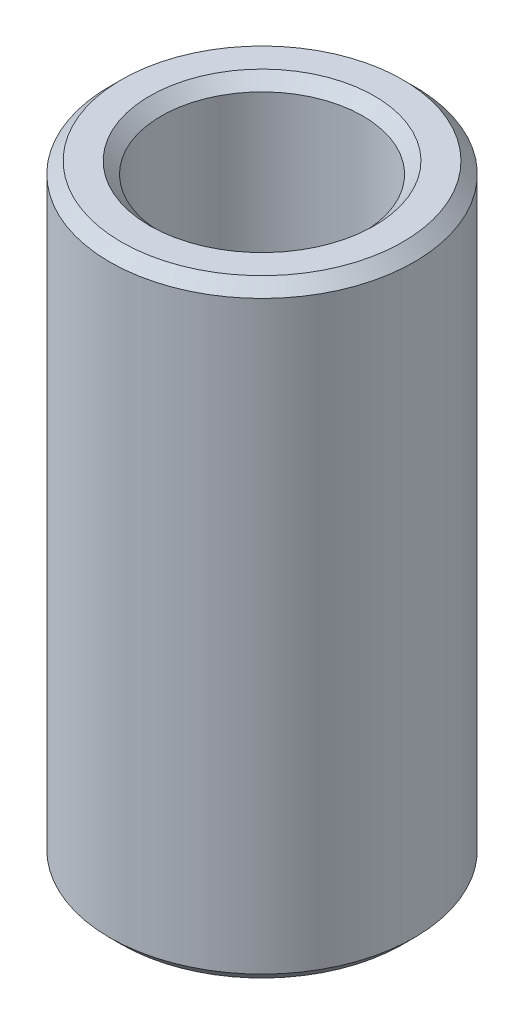
ISO-10303-21;
HEADER;
FILE_DESCRIPTION(('STEP AP214'),'2;1');
FILE_NAME('part.step','',(''),(''),'','','');
FILE_SCHEMA(('AUTOMOTIVE_DESIGN { 1 0 10303 214 1 1 1 1 }'));
ENDSEC;
DATA;
#1=APPLICATION_CONTEXT('core data for automotive mechanical design processes');
#2=APPLICATION_PROTOCOL_DEFINITION('international standard','automotive_design',2000,#1);
#3=PRODUCT_CONTEXT('',#1,'mechanical');
#4=PRODUCT('Part','Part','',(#3));
#5=PRODUCT_RELATED_PRODUCT_CATEGORY('part','',(#4));
#6=PRODUCT_DEFINITION_FORMATION('','',#4);
#7=PRODUCT_DEFINITION_CONTEXT('part definition',#1,'design');
#8=PRODUCT_DEFINITION('design','',#6,#7);
#9=PRODUCT_DEFINITION_SHAPE('','',#8);
#10=(LENGTH_UNIT() NAMED_UNIT(*) SI_UNIT(.MILLI.,.METRE.));
#11=(NAMED_UNIT(*) PLANE_ANGLE_UNIT() SI_UNIT($,.RADIAN.));
#12=(NAMED_UNIT(*) SI_UNIT($,.STERADIAN.) SOLID_ANGLE_UNIT());
#13=UNCERTAINTY_MEASURE_WITH_UNIT(LENGTH_MEASURE(1.E-05),#10,'distance_accuracy_value','');
#14=(GEOMETRIC_REPRESENTATION_CONTEXT(3) GLOBAL_UNCERTAINTY_ASSIGNED_CONTEXT((#13)) GLOBAL_UNIT_ASSIGNED_CONTEXT((#10,
#11,#12)) REPRESENTATION_CONTEXT('',''));
#15=CARTESIAN_POINT('',(0.,0.,0.));
#16=DIRECTION('',(0.,0.,1.));
#17=DIRECTION('',(1.,0.,0.));
#18=AXIS2_PLACEMENT_3D('',#15,#16,#17);
#19=CARTESIAN_POINT('',(0.,139.860274032318,0.));
#20=DIRECTION('',(0.,-1.,0.));
#21=DIRECTION('',(0.,0.,-1.));
#22=AXIS2_PLACEMENT_3D('',#19,#20,#21);
#23=CYLINDRICAL_SURFACE('',#22,35.);
#24=CARTESIAN_POINT('',(0.,2.65604760669738,0.));
#25=DIRECTION('',(0.,1.,0.));
#26=DIRECTION('',(0.,0.,1.));
#27=AXIS2_PLACEMENT_3D('',#24,#25,#26);
#28=CIRCLE('',#27,35.);
#29=CARTESIAN_POINT('',(0.,2.65604760669738,35.));
#30=VERTEX_POINT('',#29);
#31=EDGE_CURVE('E10',#30,#30,#28,.T.);
#32=ORIENTED_EDGE('',*,*,#31,.T.);
#33=EDGE_LOOP('',(#32));
#34=FACE_BOUND('',#33,.T.);
#35=CARTESIAN_POINT('',(0.,137.20422642562,0.));
#36=DIRECTION('',(0.,1.,0.));
#37=DIRECTION('',(0.,0.,1.));
#38=AXIS2_PLACEMENT_3D('',#35,#36,#37);
#39=CIRCLE('',#38,35.);
#40=CARTESIAN_POINT('',(0.,137.20422642562,35.));
#41=VERTEX_POINT('',#40);
#42=EDGE_CURVE('E50',#41,#41,#39,.F.);
#43=ORIENTED_EDGE('',*,*,#42,.T.);
#44=EDGE_LOOP('',(#43));
#45=FACE_BOUND('',#44,.T.);
#46=ADVANCED_FACE('F39',(#34,#45),#23,.T.);
#47=CARTESIAN_POINT('',(0.,139.860274032318,0.));
#48=DIRECTION('',(0.,1.,0.));
#49=DIRECTION('',(0.,0.,1.));
#50=AXIS2_PLACEMENT_3D('',#47,#48,#49);
#51=PLANE('',#50);
#52=CARTESIAN_POINT('',(0.,139.860274032318,0.));
#53=DIRECTION('',(0.,1.,0.));
#54=DIRECTION('',(0.,0.,1.));
#55=AXIS2_PLACEMENT_3D('',#52,#53,#54);
#56=CIRCLE('',#55,25.8408548168313);
#57=CARTESIAN_POINT('',(0.,139.860274032318,25.8408548168313));
#58=VERTEX_POINT('',#57);
#59=EDGE_CURVE('E58',#58,#58,#56,.F.);
#60=ORIENTED_EDGE('',*,*,#59,.T.);
#61=EDGE_LOOP('',(#60));
#62=FACE_BOUND('',#61,.T.);
#63=CARTESIAN_POINT('',(0.,139.860274032318,0.));
#64=DIRECTION('',(0.,1.,0.));
#65=DIRECTION('',(0.,0.,1.));
#66=AXIS2_PLACEMENT_3D('',#63,#64,#65);
#67=CIRCLE('',#66,32.3439523933026);
#68=CARTESIAN_POINT('',(0.,139.860274032318,32.3439523933026));
#69=VERTEX_POINT('',#68);
#70=EDGE_CURVE('E61',#69,#69,#67,.T.);
#71=ORIENTED_EDGE('',*,*,#70,.T.);
#72=EDGE_LOOP('',(#71));
#73=FACE_BOUND('',#72,.T.);
#74=ADVANCED_FACE('F88',(#62,#73),#51,.T.);
#75=CARTESIAN_POINT('',(0.,0.,0.));
#76=DIRECTION('',(0.,1.,0.));
#77=DIRECTION('',(0.,0.,1.));
#78=AXIS2_PLACEMENT_3D('',#75,#76,#77);
#79=PLANE('',#78);
#80=CARTESIAN_POINT('',(0.,0.,0.));
#81=DIRECTION('',(0.,1.,0.));
#82=DIRECTION('',(0.,0.,1.));
#83=AXIS2_PLACEMENT_3D('',#80,#81,#82);
#84=CIRCLE('',#83,25.8408548168313);
#85=CARTESIAN_POINT('',(0.,0.,25.8408548168313));
#86=VERTEX_POINT('',#85);
#87=EDGE_CURVE('E51',#86,#86,#84,.T.);
#88=ORIENTED_EDGE('',*,*,#87,.T.);
#89=EDGE_LOOP('',(#88));
#90=FACE_BOUND('',#89,.T.);
#91=CARTESIAN_POINT('',(0.,0.,0.));
#92=DIRECTION('',(0.,1.,0.));
#93=DIRECTION('',(0.,0.,1.));
#94=AXIS2_PLACEMENT_3D('',#91,#92,#93);
#95=CIRCLE('',#94,32.3439523933026);
#96=CARTESIAN_POINT('',(0.,0.,32.3439523933026));
#97=VERTEX_POINT('',#96);
#98=EDGE_CURVE('E54',#97,#97,#95,.F.);
#99=ORIENTED_EDGE('',*,*,#98,.T.);
#100=EDGE_LOOP('',(#99));
#101=FACE_BOUND('',#100,.T.);
#102=ADVANCED_FACE('F83',(#90,#101),#79,.F.);
#103=CARTESIAN_POINT('',(0.,139.860274032318,0.));
#104=DIRECTION('',(0.,-1.,0.));
#105=DIRECTION('',(0.,0.,-1.));
#106=AXIS2_PLACEMENT_3D('',#103,#104,#105);
#107=CYLINDRICAL_SURFACE('',#106,23.1848072101339);
#108=CARTESIAN_POINT('',(0.,137.20422642562,0.));
#109=DIRECTION('',(0.,1.,0.));
#110=DIRECTION('',(0.,0.,1.));
#111=AXIS2_PLACEMENT_3D('',#108,#109,#110);
#112=CIRCLE('',#111,23.1848072101339);
#113=CARTESIAN_POINT('',(0.,137.20422642562,23.1848072101339));
#114=VERTEX_POINT('',#113);
#115=EDGE_CURVE('E67',#114,#114,#112,.T.);
#116=ORIENTED_EDGE('',*,*,#115,.T.);
#117=EDGE_LOOP('',(#116));
#118=FACE_BOUND('',#117,.T.);
#119=CARTESIAN_POINT('',(0.,2.65604760669741,0.));
#120=DIRECTION('',(0.,1.,0.));
#121=DIRECTION('',(0.,0.,1.));
#122=AXIS2_PLACEMENT_3D('',#119,#120,#121);
#123=CIRCLE('',#122,23.1848072101339);
#124=CARTESIAN_POINT('',(0.,2.65604760669741,23.1848072101339));
#125=VERTEX_POINT('',#124);
#126=EDGE_CURVE('E69',#125,#125,#123,.F.);
#127=ORIENTED_EDGE('',*,*,#126,.T.);
#128=EDGE_LOOP('',(#127));
#129=FACE_BOUND('',#128,.T.);
#130=ADVANCED_FACE('F71',(#118,#129),#107,.F.);
#131=CARTESIAN_POINT('',(0.,137.20422642562,0.));
#132=DIRECTION('',(0.,1.,0.));
#133=DIRECTION('',(0.,0.,1.));
#134=AXIS2_PLACEMENT_3D('',#131,#132,#133);
#135=CONICAL_SURFACE('',#134,23.1848072101339,0.785398163397451);
#136=ORIENTED_EDGE('',*,*,#59,.F.);
#137=EDGE_LOOP('',(#136));
#138=FACE_BOUND('',#137,.T.);
#139=ORIENTED_EDGE('',*,*,#115,.F.);
#140=EDGE_LOOP('',(#139));
#141=FACE_BOUND('',#140,.T.);
#142=ADVANCED_FACE('F77',(#138,#141),#135,.F.);
#143=CARTESIAN_POINT('',(0.,0.,0.));
#144=DIRECTION('',(0.,-1.,0.));
#145=DIRECTION('',(0.,0.,-1.));
#146=AXIS2_PLACEMENT_3D('',#143,#144,#145);
#147=CONICAL_SURFACE('',#146,25.8408548168313,0.785398163397442);
#148=ORIENTED_EDGE('',*,*,#126,.F.);
#149=EDGE_LOOP('',(#148));
#150=FACE_BOUND('',#149,.T.);
#151=ORIENTED_EDGE('',*,*,#87,.F.);
#152=EDGE_LOOP('',(#151));
#153=FACE_BOUND('',#152,.T.);
#154=ADVANCED_FACE('F73',(#150,#153),#147,.F.);
#155=CARTESIAN_POINT('',(0.,2.65604760669738,0.));
#156=DIRECTION('',(0.,1.,0.));
#157=DIRECTION('',(0.,0.,1.));
#158=AXIS2_PLACEMENT_3D('',#155,#156,#157);
#159=CONICAL_SURFACE('',#158,35.,0.785398163397452);
#160=ORIENTED_EDGE('',*,*,#98,.F.);
#161=EDGE_LOOP('',(#160));
#162=FACE_BOUND('',#161,.T.);
#163=ORIENTED_EDGE('',*,*,#31,.F.);
#164=EDGE_LOOP('',(#163));
#165=FACE_BOUND('',#164,.T.);
#166=ADVANCED_FACE('F76',(#162,#165),#159,.T.);
#167=CARTESIAN_POINT('',(0.,139.860274032318,0.));
#168=DIRECTION('',(0.,-1.,0.));
#169=DIRECTION('',(0.,0.,-1.));
#170=AXIS2_PLACEMENT_3D('',#167,#168,#169);
#171=CONICAL_SURFACE('',#170,32.3439523933026,0.78539816339745);
#172=ORIENTED_EDGE('',*,*,#42,.F.);
#173=EDGE_LOOP('',(#172));
#174=FACE_BOUND('',#173,.T.);
#175=ORIENTED_EDGE('',*,*,#70,.F.);
#176=EDGE_LOOP('',(#175));
#177=FACE_BOUND('',#176,.T.);
#178=ADVANCED_FACE('F45',(#174,#177),#171,.T.);
#179=CLOSED_SHELL('',(#46,#74,#102,#130,#142,#154,#166,#178));
#180=MANIFOLD_SOLID_BREP('B2',#179);
#181=ADVANCED_BREP_SHAPE_REPRESENTATION('',(#18,#180),#14);
#182=SHAPE_DEFINITION_REPRESENTATION(#9,#181);
ENDSEC;
END-ISO-10303-21;
